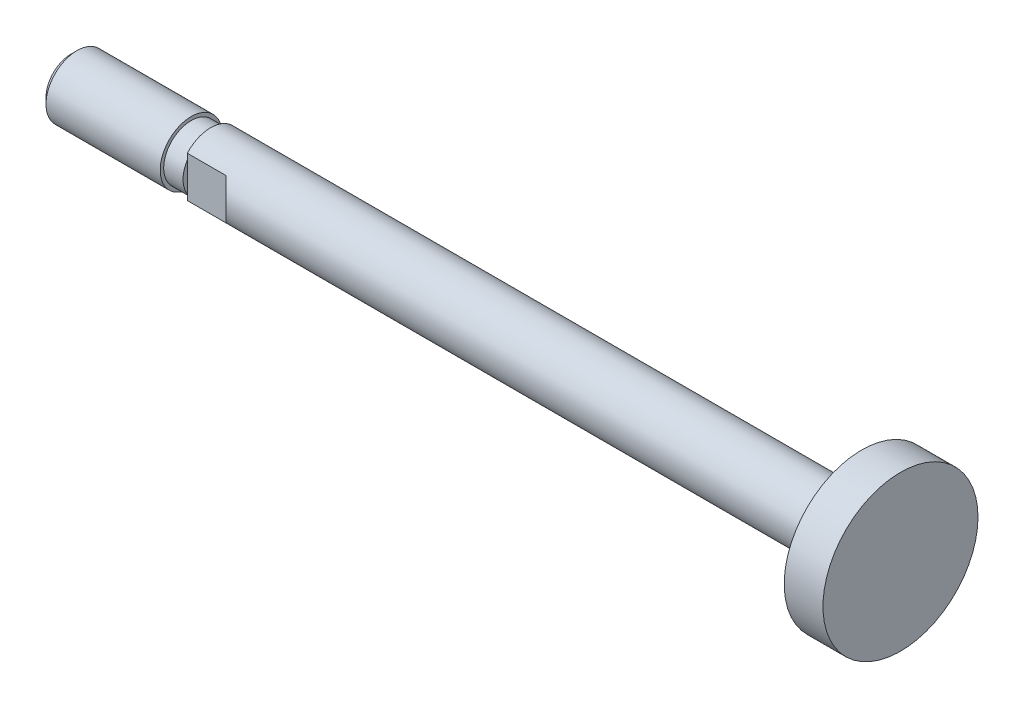
ISO-10303-21;
HEADER;
FILE_DESCRIPTION(('STEP AP214'),'2;1');
FILE_NAME('part.step','',(''),(''),'','','');
FILE_SCHEMA(('AUTOMOTIVE_DESIGN { 1 0 10303 214 1 1 1 1 }'));
ENDSEC;
DATA;
#1=APPLICATION_CONTEXT('core data for automotive mechanical design processes');
#2=APPLICATION_PROTOCOL_DEFINITION('international standard','automotive_design',2000,#1);
#3=PRODUCT_CONTEXT('',#1,'mechanical');
#4=PRODUCT('Part','Part','',(#3));
#5=PRODUCT_RELATED_PRODUCT_CATEGORY('part','',(#4));
#6=PRODUCT_DEFINITION_FORMATION('','',#4);
#7=PRODUCT_DEFINITION_CONTEXT('part definition',#1,'design');
#8=PRODUCT_DEFINITION('design','',#6,#7);
#9=PRODUCT_DEFINITION_SHAPE('','',#8);
#10=(LENGTH_UNIT() NAMED_UNIT(*) SI_UNIT(.MILLI.,.METRE.));
#11=(NAMED_UNIT(*) PLANE_ANGLE_UNIT() SI_UNIT($,.RADIAN.));
#12=(NAMED_UNIT(*) SI_UNIT($,.STERADIAN.) SOLID_ANGLE_UNIT());
#13=UNCERTAINTY_MEASURE_WITH_UNIT(LENGTH_MEASURE(1.E-05),#10,'distance_accuracy_value','');
#14=(GEOMETRIC_REPRESENTATION_CONTEXT(3) GLOBAL_UNCERTAINTY_ASSIGNED_CONTEXT((#13)) GLOBAL_UNIT_ASSIGNED_CONTEXT((#10,
#11,#12)) REPRESENTATION_CONTEXT('',''));
#15=CARTESIAN_POINT('',(0.,0.,0.));
#16=DIRECTION('',(0.,0.,1.));
#17=DIRECTION('',(1.,0.,0.));
#18=AXIS2_PLACEMENT_3D('',#15,#16,#17);
#19=CARTESIAN_POINT('',(-43.,4.,3.));
#20=DIRECTION('',(1.,0.,0.));
#21=DIRECTION('',(0.,1.,0.));
#22=AXIS2_PLACEMENT_3D('',#19,#20,#21);
#23=PLANE('',#22);
#24=CARTESIAN_POINT('',(-43.,0.,0.));
#25=DIRECTION('',(1.,0.,0.));
#26=DIRECTION('',(0.,0.,-1.));
#27=AXIS2_PLACEMENT_3D('',#24,#25,#26);
#28=CIRCLE('',#27,3.54999999999995);
#29=CARTESIAN_POINT('',(-43.,1.89802528961015,3.));
#30=VERTEX_POINT('',#29);
#31=CARTESIAN_POINT('',(-43.,-1.89802528961015,3.));
#32=VERTEX_POINT('',#31);
#33=EDGE_CURVE('E163',#30,#32,#28,.T.);
#34=ORIENTED_EDGE('',*,*,#33,.T.);
#35=DIRECTION('',(0.,-1.,0.));
#36=VECTOR('',#35,1.);
#37=CARTESIAN_POINT('',(-43.,4.,3.));
#38=LINE('',#37,#36);
#39=EDGE_CURVE('E11',#30,#32,#38,.T.);
#40=ORIENTED_EDGE('',*,*,#39,.F.);
#41=EDGE_LOOP('',(#34,#40));
#42=FACE_BOUND('',#41,.T.);
#43=ADVANCED_FACE('F16',(#42),#23,.T.);
#44=CARTESIAN_POINT('',(-38.,4.,3.));
#45=DIRECTION('',(0.,0.,1.));
#46=DIRECTION('',(1.,0.,0.));
#47=AXIS2_PLACEMENT_3D('',#44,#45,#46);
#48=PLANE('',#47);
#49=DIRECTION('',(1.,0.,0.));
#50=VECTOR('',#49,1.);
#51=CARTESIAN_POINT('',(46.,-2.64575131106459,3.));
#52=LINE('',#51,#50);
#53=CARTESIAN_POINT('',(-43.,-2.64575131106459,3.));
#54=VERTEX_POINT('',#53);
#55=CARTESIAN_POINT('',(-38.,-2.64575131106459,3.));
#56=VERTEX_POINT('',#55);
#57=EDGE_CURVE('E154',#54,#56,#52,.T.);
#58=ORIENTED_EDGE('',*,*,#57,.T.);
#59=DIRECTION('',(0.,-1.,0.));
#60=VECTOR('',#59,1.);
#61=CARTESIAN_POINT('',(-38.,4.,3.));
#62=LINE('',#61,#60);
#63=CARTESIAN_POINT('',(-38.,2.64575131106459,3.));
#64=VERTEX_POINT('',#63);
#65=EDGE_CURVE('E26',#64,#56,#62,.T.);
#66=ORIENTED_EDGE('',*,*,#65,.F.);
#67=DIRECTION('',(-1.,0.,0.));
#68=VECTOR('',#67,1.);
#69=CARTESIAN_POINT('',(46.,2.64575131106459,3.));
#70=LINE('',#69,#68);
#71=CARTESIAN_POINT('',(-43.,2.64575131106459,3.));
#72=VERTEX_POINT('',#71);
#73=EDGE_CURVE('E149',#64,#72,#70,.T.);
#74=ORIENTED_EDGE('',*,*,#73,.T.);
#75=DIRECTION('',(0.,-1.,0.));
#76=VECTOR('',#75,1.);
#77=CARTESIAN_POINT('',(-43.,4.,3.));
#78=LINE('',#77,#76);
#79=EDGE_CURVE('E196',#72,#30,#78,.T.);
#80=ORIENTED_EDGE('',*,*,#79,.T.);
#81=ORIENTED_EDGE('',*,*,#39,.T.);
#82=DIRECTION('',(0.,-1.,0.));
#83=VECTOR('',#82,1.);
#84=CARTESIAN_POINT('',(-43.,4.,3.));
#85=LINE('',#84,#83);
#86=EDGE_CURVE('E170',#32,#54,#85,.T.);
#87=ORIENTED_EDGE('',*,*,#86,.T.);
#88=EDGE_LOOP('',(#58,#66,#74,#80,#81,#87));
#89=FACE_BOUND('',#88,.T.);
#90=ADVANCED_FACE('F229',(#89),#48,.T.);
#91=CARTESIAN_POINT('',(-35.6666666666666,4.,5.33333333333333));
#92=DIRECTION('',(-0.707106781186542,0.,0.707106781186553));
#93=DIRECTION('',(0.,1.,0.));
#94=AXIS2_PLACEMENT_3D('',#91,#92,#93);
#95=PLANE('',#94);
#96=CARTESIAN_POINT('',(-41.,0.,0.));
#97=DIRECTION('',(-0.707106781186542,0.,0.707106781186553));
#98=DIRECTION('',(0.707106781186553,0.,0.707106781186542));
#99=AXIS2_PLACEMENT_3D('',#96,#97,#98);
#100=ELLIPSE('',#99,5.65685424949242,4.);
#101=EDGE_CURVE('E142',#56,#64,#100,.T.);
#102=ORIENTED_EDGE('',*,*,#101,.T.);
#103=ORIENTED_EDGE('',*,*,#65,.T.);
#104=EDGE_LOOP('',(#102,#103));
#105=FACE_BOUND('',#104,.T.);
#106=ADVANCED_FACE('F231',(#105),#95,.T.);
#107=CARTESIAN_POINT('',(-43.,4.,-4.));
#108=DIRECTION('',(1.,0.,0.));
#109=DIRECTION('',(0.,1.,0.));
#110=AXIS2_PLACEMENT_3D('',#107,#108,#109);
#111=PLANE('',#110);
#112=CARTESIAN_POINT('',(-43.,0.,0.));
#113=DIRECTION('',(1.,0.,0.));
#114=DIRECTION('',(0.,0.,-1.));
#115=AXIS2_PLACEMENT_3D('',#112,#113,#114);
#116=CIRCLE('',#115,3.54999999999995);
#117=CARTESIAN_POINT('',(-43.,-1.89802528961015,-3.));
#118=VERTEX_POINT('',#117);
#119=CARTESIAN_POINT('',(-43.,1.89802528961015,-3.));
#120=VERTEX_POINT('',#119);
#121=EDGE_CURVE('E132',#118,#120,#116,.T.);
#122=ORIENTED_EDGE('',*,*,#121,.T.);
#123=DIRECTION('',(0.,-1.,0.));
#124=VECTOR('',#123,1.);
#125=CARTESIAN_POINT('',(-43.,4.,-3.));
#126=LINE('',#125,#124);
#127=EDGE_CURVE('E87',#120,#118,#126,.T.);
#128=ORIENTED_EDGE('',*,*,#127,.T.);
#129=EDGE_LOOP('',(#122,#128));
#130=FACE_BOUND('',#129,.T.);
#131=ADVANCED_FACE('F251',(#130),#111,.T.);
#132=CARTESIAN_POINT('',(-43.,4.,-3.));
#133=DIRECTION('',(0.,0.,-1.));
#134=DIRECTION('',(0.,-1.,0.));
#135=AXIS2_PLACEMENT_3D('',#132,#133,#134);
#136=PLANE('',#135);
#137=DIRECTION('',(1.,0.,0.));
#138=VECTOR('',#137,1.);
#139=CARTESIAN_POINT('',(46.,2.64575131106459,-3.));
#140=LINE('',#139,#138);
#141=CARTESIAN_POINT('',(-43.,2.64575131106459,-3.));
#142=VERTEX_POINT('',#141);
#143=CARTESIAN_POINT('',(-38.,2.6457513110646,-3.));
#144=VERTEX_POINT('',#143);
#145=EDGE_CURVE('E145',#142,#144,#140,.T.);
#146=ORIENTED_EDGE('',*,*,#145,.T.);
#147=DIRECTION('',(0.,-1.,0.));
#148=VECTOR('',#147,1.);
#149=CARTESIAN_POINT('',(-38.,4.,-3.));
#150=LINE('',#149,#148);
#151=CARTESIAN_POINT('',(-38.,-2.6457513110646,-3.));
#152=VERTEX_POINT('',#151);
#153=EDGE_CURVE('E137',#144,#152,#150,.T.);
#154=ORIENTED_EDGE('',*,*,#153,.T.);
#155=DIRECTION('',(-1.,0.,0.));
#156=VECTOR('',#155,1.);
#157=CARTESIAN_POINT('',(46.,-2.64575131106459,-3.));
#158=LINE('',#157,#156);
#159=CARTESIAN_POINT('',(-43.,-2.64575131106459,-3.));
#160=VERTEX_POINT('',#159);
#161=EDGE_CURVE('E151',#152,#160,#158,.T.);
#162=ORIENTED_EDGE('',*,*,#161,.T.);
#163=DIRECTION('',(0.,-1.,0.));
#164=VECTOR('',#163,1.);
#165=CARTESIAN_POINT('',(-43.,4.,-3.));
#166=LINE('',#165,#164);
#167=EDGE_CURVE('E160',#118,#160,#166,.T.);
#168=ORIENTED_EDGE('',*,*,#167,.F.);
#169=ORIENTED_EDGE('',*,*,#127,.F.);
#170=DIRECTION('',(0.,-1.,0.));
#171=VECTOR('',#170,1.);
#172=CARTESIAN_POINT('',(-43.,4.,-3.));
#173=LINE('',#172,#171);
#174=EDGE_CURVE('E159',#142,#120,#173,.T.);
#175=ORIENTED_EDGE('',*,*,#174,.F.);
#176=EDGE_LOOP('',(#146,#154,#162,#168,#169,#175));
#177=FACE_BOUND('',#176,.T.);
#178=ADVANCED_FACE('F238',(#177),#136,.T.);
#179=CARTESIAN_POINT('',(-38.,4.,-3.));
#180=DIRECTION('',(-0.707106781186549,0.,-0.707106781186546));
#181=DIRECTION('',(-0.707106781186546,0.,0.707106781186549));
#182=AXIS2_PLACEMENT_3D('',#179,#180,#181);
#183=PLANE('',#182);
#184=CARTESIAN_POINT('',(-41.,0.,0.));
#185=DIRECTION('',(-0.707106781186549,0.,-0.707106781186546));
#186=DIRECTION('',(0.707106781186546,0.,-0.707106781186549));
#187=AXIS2_PLACEMENT_3D('',#184,#185,#186);
#188=ELLIPSE('',#187,5.65685424949237,4.);
#189=EDGE_CURVE('E150',#144,#152,#188,.T.);
#190=ORIENTED_EDGE('',*,*,#189,.T.);
#191=ORIENTED_EDGE('',*,*,#153,.F.);
#192=EDGE_LOOP('',(#190,#191));
#193=FACE_BOUND('',#192,.T.);
#194=ADVANCED_FACE('F240',(#193),#183,.T.);
#195=CARTESIAN_POINT('',(46.,10.,0.));
#196=DIRECTION('',(-1.,0.,0.));
#197=DIRECTION('',(0.,0.,1.));
#198=AXIS2_PLACEMENT_3D('',#195,#196,#197);
#199=PLANE('',#198);
#200=CARTESIAN_POINT('',(46.,0.,0.));
#201=DIRECTION('',(1.,0.,0.));
#202=DIRECTION('',(0.,0.,-1.));
#203=AXIS2_PLACEMENT_3D('',#200,#201,#202);
#204=CIRCLE('',#203,10.);
#205=CARTESIAN_POINT('',(46.,0.,-10.));
#206=VERTEX_POINT('',#205);
#207=EDGE_CURVE('E38',#206,#206,#204,.T.);
#208=ORIENTED_EDGE('',*,*,#207,.T.);
#209=EDGE_LOOP('',(#208));
#210=FACE_BOUND('',#209,.T.);
#211=ADVANCED_FACE('F242',(#210),#199,.F.);
#212=CARTESIAN_POINT('',(46.,0.,0.));
#213=DIRECTION('',(1.,0.,0.));
#214=DIRECTION('',(0.,0.,-1.));
#215=AXIS2_PLACEMENT_3D('',#212,#213,#214);
#216=CYLINDRICAL_SURFACE('',#215,10.);
#217=CARTESIAN_POINT('',(41.,0.,0.));
#218=DIRECTION('',(1.,0.,0.));
#219=DIRECTION('',(0.,0.,-1.));
#220=AXIS2_PLACEMENT_3D('',#217,#218,#219);
#221=CIRCLE('',#220,10.);
#222=CARTESIAN_POINT('',(41.,0.,-10.));
#223=VERTEX_POINT('',#222);
#224=EDGE_CURVE('E164',#223,#223,#221,.T.);
#225=ORIENTED_EDGE('',*,*,#224,.T.);
#226=EDGE_LOOP('',(#225));
#227=FACE_BOUND('',#226,.T.);
#228=ORIENTED_EDGE('',*,*,#207,.F.);
#229=EDGE_LOOP('',(#228));
#230=FACE_BOUND('',#229,.T.);
#231=ADVANCED_FACE('F249',(#227,#230),#216,.T.);
#232=CARTESIAN_POINT('',(41.,4.,0.));
#233=DIRECTION('',(1.,0.,0.));
#234=DIRECTION('',(0.,1.,0.));
#235=AXIS2_PLACEMENT_3D('',#232,#233,#234);
#236=PLANE('',#235);
#237=CARTESIAN_POINT('',(41.,0.,0.));
#238=DIRECTION('',(1.,0.,0.));
#239=DIRECTION('',(0.,0.,-1.));
#240=AXIS2_PLACEMENT_3D('',#237,#238,#239);
#241=CIRCLE('',#240,4.);
#242=CARTESIAN_POINT('',(41.,0.,-4.));
#243=VERTEX_POINT('',#242);
#244=EDGE_CURVE('E183',#243,#243,#241,.T.);
#245=ORIENTED_EDGE('',*,*,#244,.T.);
#246=EDGE_LOOP('',(#245));
#247=FACE_BOUND('',#246,.T.);
#248=ORIENTED_EDGE('',*,*,#224,.F.);
#249=EDGE_LOOP('',(#248));
#250=FACE_BOUND('',#249,.T.);
#251=ADVANCED_FACE('F276',(#247,#250),#236,.F.);
#252=CARTESIAN_POINT('',(46.,0.,0.));
#253=DIRECTION('',(1.,0.,0.));
#254=DIRECTION('',(0.,0.,-1.));
#255=AXIS2_PLACEMENT_3D('',#252,#253,#254);
#256=CYLINDRICAL_SURFACE('',#255,3.54999999999995);
#257=CARTESIAN_POINT('',(-45.5,0.,0.));
#258=DIRECTION('',(1.,0.,0.));
#259=DIRECTION('',(0.,0.,-1.));
#260=AXIS2_PLACEMENT_3D('',#257,#258,#259);
#261=CIRCLE('',#260,3.54999999999995);
#262=CARTESIAN_POINT('',(-45.5,0.,-3.54999999999995));
#263=VERTEX_POINT('',#262);
#264=EDGE_CURVE('E115',#263,#263,#261,.T.);
#265=ORIENTED_EDGE('',*,*,#264,.T.);
#266=EDGE_LOOP('',(#265));
#267=FACE_BOUND('',#266,.T.);
#268=CARTESIAN_POINT('',(-43.,0.,0.));
#269=DIRECTION('',(1.,0.,0.));
#270=DIRECTION('',(0.,0.,-1.));
#271=AXIS2_PLACEMENT_3D('',#268,#269,#270);
#272=CIRCLE('',#271,3.54999999999995);
#273=EDGE_CURVE('E176',#120,#30,#272,.T.);
#274=ORIENTED_EDGE('',*,*,#273,.F.);
#275=ORIENTED_EDGE('',*,*,#121,.F.);
#276=CARTESIAN_POINT('',(-43.,0.,0.));
#277=DIRECTION('',(1.,0.,0.));
#278=DIRECTION('',(0.,0.,-1.));
#279=AXIS2_PLACEMENT_3D('',#276,#277,#278);
#280=CIRCLE('',#279,3.54999999999995);
#281=EDGE_CURVE('E167',#32,#118,#280,.T.);
#282=ORIENTED_EDGE('',*,*,#281,.F.);
#283=ORIENTED_EDGE('',*,*,#33,.F.);
#284=EDGE_LOOP('',(#274,#275,#282,#283));
#285=FACE_BOUND('',#284,.T.);
#286=ADVANCED_FACE('F260',(#267,#285),#256,.T.);
#287=CARTESIAN_POINT('',(-45.5,4.,0.));
#288=DIRECTION('',(-1.,0.,0.));
#289=DIRECTION('',(0.,0.,1.));
#290=AXIS2_PLACEMENT_3D('',#287,#288,#289);
#291=PLANE('',#290);
#292=CARTESIAN_POINT('',(-45.5,0.,0.));
#293=DIRECTION('',(1.,0.,0.));
#294=DIRECTION('',(0.,0.,-1.));
#295=AXIS2_PLACEMENT_3D('',#292,#293,#294);
#296=CIRCLE('',#295,4.);
#297=CARTESIAN_POINT('',(-45.5,0.,-4.));
#298=VERTEX_POINT('',#297);
#299=EDGE_CURVE('E121',#298,#298,#296,.T.);
#300=ORIENTED_EDGE('',*,*,#299,.T.);
#301=EDGE_LOOP('',(#300));
#302=FACE_BOUND('',#301,.T.);
#303=ORIENTED_EDGE('',*,*,#264,.F.);
#304=EDGE_LOOP('',(#303));
#305=FACE_BOUND('',#304,.T.);
#306=ADVANCED_FACE('F122',(#302,#305),#291,.F.);
#307=CARTESIAN_POINT('',(46.,0.,0.));
#308=DIRECTION('',(1.,0.,0.));
#309=DIRECTION('',(0.,0.,-1.));
#310=AXIS2_PLACEMENT_3D('',#307,#308,#309);
#311=CYLINDRICAL_SURFACE('',#310,4.);
#312=CARTESIAN_POINT('',(-60.233,0.,0.));
#313=DIRECTION('',(1.,0.,0.));
#314=DIRECTION('',(0.,0.,-1.));
#315=AXIS2_PLACEMENT_3D('',#312,#313,#314);
#316=CIRCLE('',#315,4.);
#317=CARTESIAN_POINT('',(-60.233,0.,-4.));
#318=VERTEX_POINT('',#317);
#319=EDGE_CURVE('E126',#318,#318,#316,.T.);
#320=ORIENTED_EDGE('',*,*,#319,.T.);
#321=EDGE_LOOP('',(#320));
#322=FACE_BOUND('',#321,.T.);
#323=ORIENTED_EDGE('',*,*,#299,.F.);
#324=EDGE_LOOP('',(#323));
#325=FACE_BOUND('',#324,.T.);
#326=ADVANCED_FACE('F310',(#322,#325),#311,.T.);
#327=CARTESIAN_POINT('',(-61.,0.,0.));
#328=DIRECTION('',(1.,0.,0.));
#329=DIRECTION('',(0.,0.,-1.));
#330=AXIS2_PLACEMENT_3D('',#327,#328,#329);
#331=CONICAL_SURFACE('',#330,3.233,0.785398163397446);
#332=CARTESIAN_POINT('',(-61.,0.,0.));
#333=DIRECTION('',(1.,0.,0.));
#334=DIRECTION('',(0.,0.,-1.));
#335=AXIS2_PLACEMENT_3D('',#332,#333,#334);
#336=CIRCLE('',#335,3.233);
#337=CARTESIAN_POINT('',(-61.,0.,-3.233));
#338=VERTEX_POINT('',#337);
#339=EDGE_CURVE('E134',#338,#338,#336,.T.);
#340=ORIENTED_EDGE('',*,*,#339,.T.);
#341=EDGE_LOOP('',(#340));
#342=FACE_BOUND('',#341,.T.);
#343=ORIENTED_EDGE('',*,*,#319,.F.);
#344=EDGE_LOOP('',(#343));
#345=FACE_BOUND('',#344,.T.);
#346=ADVANCED_FACE('F317',(#342,#345),#331,.T.);
#347=CARTESIAN_POINT('',(-61.,0.,0.));
#348=DIRECTION('',(1.,0.,0.));
#349=DIRECTION('',(0.,1.,0.));
#350=AXIS2_PLACEMENT_3D('',#347,#348,#349);
#351=PLANE('',#350);
#352=ORIENTED_EDGE('',*,*,#339,.F.);
#353=EDGE_LOOP('',(#352));
#354=FACE_BOUND('',#353,.T.);
#355=ADVANCED_FACE('F273',(#354),#351,.F.);
#356=CARTESIAN_POINT('',(46.,0.,0.));
#357=DIRECTION('',(1.,0.,0.));
#358=DIRECTION('',(0.,0.,-1.));
#359=AXIS2_PLACEMENT_3D('',#356,#357,#358);
#360=CYLINDRICAL_SURFACE('',#359,4.);
#361=ORIENTED_EDGE('',*,*,#57,.F.);
#362=CARTESIAN_POINT('',(-43.,0.,0.));
#363=DIRECTION('',(1.,0.,0.));
#364=DIRECTION('',(0.,0.,-1.));
#365=AXIS2_PLACEMENT_3D('',#362,#363,#364);
#366=CIRCLE('',#365,4.);
#367=EDGE_CURVE('E155',#54,#160,#366,.T.);
#368=ORIENTED_EDGE('',*,*,#367,.T.);
#369=ORIENTED_EDGE('',*,*,#161,.F.);
#370=ORIENTED_EDGE('',*,*,#189,.F.);
#371=ORIENTED_EDGE('',*,*,#145,.F.);
#372=CARTESIAN_POINT('',(-43.,0.,0.));
#373=DIRECTION('',(1.,0.,0.));
#374=DIRECTION('',(0.,0.,-1.));
#375=AXIS2_PLACEMENT_3D('',#372,#373,#374);
#376=CIRCLE('',#375,4.);
#377=EDGE_CURVE('E19',#142,#72,#376,.T.);
#378=ORIENTED_EDGE('',*,*,#377,.T.);
#379=ORIENTED_EDGE('',*,*,#73,.F.);
#380=ORIENTED_EDGE('',*,*,#101,.F.);
#381=EDGE_LOOP('',(#361,#368,#369,#370,#371,#378,#379,#380));
#382=FACE_BOUND('',#381,.T.);
#383=ORIENTED_EDGE('',*,*,#244,.F.);
#384=EDGE_LOOP('',(#383));
#385=FACE_BOUND('',#384,.T.);
#386=ADVANCED_FACE('F221',(#382,#385),#360,.T.);
#387=CARTESIAN_POINT('',(-43.,3.54999999999995,0.));
#388=DIRECTION('',(1.,0.,0.));
#389=DIRECTION('',(0.,1.,0.));
#390=AXIS2_PLACEMENT_3D('',#387,#388,#389);
#391=PLANE('',#390);
#392=ORIENTED_EDGE('',*,*,#174,.T.);
#393=ORIENTED_EDGE('',*,*,#273,.T.);
#394=ORIENTED_EDGE('',*,*,#79,.F.);
#395=ORIENTED_EDGE('',*,*,#377,.F.);
#396=EDGE_LOOP('',(#392,#393,#394,#395));
#397=FACE_BOUND('',#396,.T.);
#398=ADVANCED_FACE('F226',(#397),#391,.F.);
#399=CARTESIAN_POINT('',(-43.,3.54999999999995,0.));
#400=DIRECTION('',(1.,0.,0.));
#401=DIRECTION('',(0.,1.,0.));
#402=AXIS2_PLACEMENT_3D('',#399,#400,#401);
#403=PLANE('',#402);
#404=ORIENTED_EDGE('',*,*,#86,.F.);
#405=ORIENTED_EDGE('',*,*,#281,.T.);
#406=ORIENTED_EDGE('',*,*,#167,.T.);
#407=ORIENTED_EDGE('',*,*,#367,.F.);
#408=EDGE_LOOP('',(#404,#405,#406,#407));
#409=FACE_BOUND('',#408,.T.);
#410=ADVANCED_FACE('F236',(#409),#403,.F.);
#411=CLOSED_SHELL('',(#43,#90,#106,#131,#178,#194,#211,#231,#251,#286,#306,#326,#346,#355,#386,
#398,#410));
#412=MANIFOLD_SOLID_BREP('B1',#411);
#413=ADVANCED_BREP_SHAPE_REPRESENTATION('',(#18,#412),#14);
#414=SHAPE_DEFINITION_REPRESENTATION(#9,#413);
ENDSEC;
END-ISO-10303-21;
